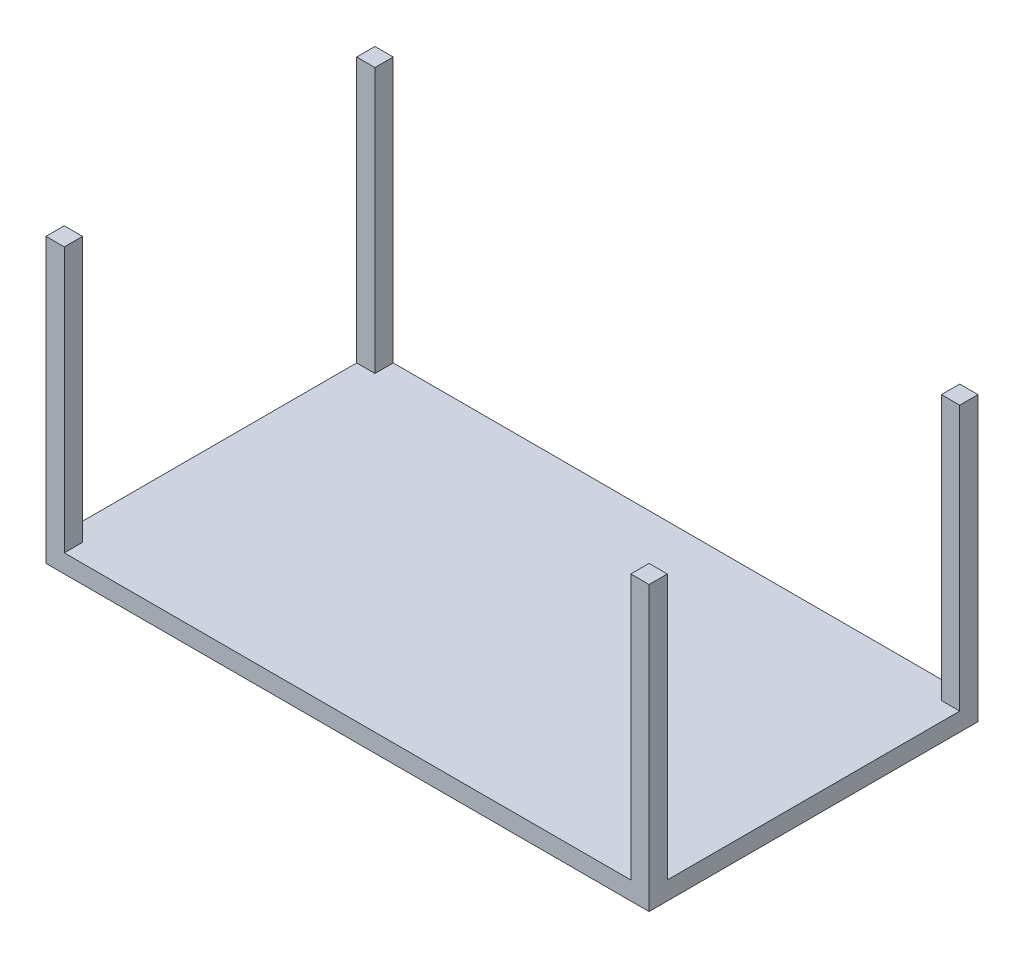
ISO-10303-21;
HEADER;
FILE_DESCRIPTION(('STEP AP214'),'2;1');
FILE_NAME('part.step','',(''),(''),'','','');
FILE_SCHEMA(('AUTOMOTIVE_DESIGN { 1 0 10303 214 1 1 1 1 }'));
ENDSEC;
DATA;
#1=APPLICATION_CONTEXT('core data for automotive mechanical design processes');
#2=APPLICATION_PROTOCOL_DEFINITION('international standard','automotive_design',2000,#1);
#3=PRODUCT_CONTEXT('',#1,'mechanical');
#4=PRODUCT('Part','Part','',(#3));
#5=PRODUCT_RELATED_PRODUCT_CATEGORY('part','',(#4));
#6=PRODUCT_DEFINITION_FORMATION('','',#4);
#7=PRODUCT_DEFINITION_CONTEXT('part definition',#1,'design');
#8=PRODUCT_DEFINITION('design','',#6,#7);
#9=PRODUCT_DEFINITION_SHAPE('','',#8);
#10=(LENGTH_UNIT() NAMED_UNIT(*) SI_UNIT(.MILLI.,.METRE.));
#11=(NAMED_UNIT(*) PLANE_ANGLE_UNIT() SI_UNIT($,.RADIAN.));
#12=(NAMED_UNIT(*) SI_UNIT($,.STERADIAN.) SOLID_ANGLE_UNIT());
#13=UNCERTAINTY_MEASURE_WITH_UNIT(LENGTH_MEASURE(1.E-05),#10,'distance_accuracy_value','');
#14=(GEOMETRIC_REPRESENTATION_CONTEXT(3) GLOBAL_UNCERTAINTY_ASSIGNED_CONTEXT((#13)) GLOBAL_UNIT_ASSIGNED_CONTEXT((#10,
#11,#12)) REPRESENTATION_CONTEXT('',''));
#15=CARTESIAN_POINT('',(0.,0.,0.));
#16=DIRECTION('',(0.,0.,1.));
#17=DIRECTION('',(1.,0.,0.));
#18=AXIS2_PLACEMENT_3D('',#15,#16,#17);
#19=CARTESIAN_POINT('',(0.,50.8,0.));
#20=DIRECTION('',(0.,-1.,0.));
#21=DIRECTION('',(0.,0.,-1.));
#22=AXIS2_PLACEMENT_3D('',#19,#20,#21);
#23=PLANE('',#22);
#24=DIRECTION('',(0.,0.,-1.));
#25=VECTOR('',#24,1.);
#26=CARTESIAN_POINT('',(-787.4,50.8,457.2));
#27=LINE('',#26,#25);
#28=CARTESIAN_POINT('',(-787.4,50.8,457.2));
#29=VERTEX_POINT('',#28);
#30=CARTESIAN_POINT('',(-787.4,50.8,406.4));
#31=VERTEX_POINT('',#30);
#32=EDGE_CURVE('E197',#29,#31,#27,.T.);
#33=ORIENTED_EDGE('',*,*,#32,.F.);
#34=DIRECTION('',(1.,0.,0.));
#35=VECTOR('',#34,1.);
#36=CARTESIAN_POINT('',(-838.2,50.8,457.2));
#37=LINE('',#36,#35);
#38=CARTESIAN_POINT('',(787.4,50.8,457.2));
#39=VERTEX_POINT('',#38);
#40=EDGE_CURVE('E313',#29,#39,#37,.T.);
#41=ORIENTED_EDGE('',*,*,#40,.T.);
#42=DIRECTION('',(0.,0.,1.));
#43=VECTOR('',#42,1.);
#44=CARTESIAN_POINT('',(787.4,50.8,457.2));
#45=LINE('',#44,#43);
#46=CARTESIAN_POINT('',(787.4,50.8,406.4));
#47=VERTEX_POINT('',#46);
#48=EDGE_CURVE('E215',#47,#39,#45,.T.);
#49=ORIENTED_EDGE('',*,*,#48,.F.);
#50=DIRECTION('',(-1.,0.,0.));
#51=VECTOR('',#50,1.);
#52=CARTESIAN_POINT('',(838.2,50.8,406.4));
#53=LINE('',#52,#51);
#54=CARTESIAN_POINT('',(838.2,50.8,406.4));
#55=VERTEX_POINT('',#54);
#56=EDGE_CURVE('E209',#55,#47,#53,.T.);
#57=ORIENTED_EDGE('',*,*,#56,.F.);
#58=DIRECTION('',(0.,0.,-1.));
#59=VECTOR('',#58,1.);
#60=CARTESIAN_POINT('',(838.2,50.8,457.2));
#61=LINE('',#60,#59);
#62=CARTESIAN_POINT('',(838.2,50.8,-406.4));
#63=VERTEX_POINT('',#62);
#64=EDGE_CURVE('E305',#55,#63,#61,.T.);
#65=ORIENTED_EDGE('',*,*,#64,.T.);
#66=DIRECTION('',(1.,0.,0.));
#67=VECTOR('',#66,1.);
#68=CARTESIAN_POINT('',(838.2,50.8,-406.4));
#69=LINE('',#68,#67);
#70=CARTESIAN_POINT('',(787.4,50.8,-406.4));
#71=VERTEX_POINT('',#70);
#72=EDGE_CURVE('E246',#71,#63,#69,.T.);
#73=ORIENTED_EDGE('',*,*,#72,.F.);
#74=DIRECTION('',(0.,0.,1.));
#75=VECTOR('',#74,1.);
#76=CARTESIAN_POINT('',(787.4,50.8,-457.2));
#77=LINE('',#76,#75);
#78=CARTESIAN_POINT('',(787.4,50.8,-457.2));
#79=VERTEX_POINT('',#78);
#80=EDGE_CURVE('E241',#79,#71,#77,.T.);
#81=ORIENTED_EDGE('',*,*,#80,.F.);
#82=DIRECTION('',(-1.,0.,0.));
#83=VECTOR('',#82,1.);
#84=CARTESIAN_POINT('',(-838.2,50.8,-457.2));
#85=LINE('',#84,#83);
#86=CARTESIAN_POINT('',(-787.4,50.8,-457.2));
#87=VERTEX_POINT('',#86);
#88=EDGE_CURVE('E308',#79,#87,#85,.T.);
#89=ORIENTED_EDGE('',*,*,#88,.T.);
#90=DIRECTION('',(0.,0.,-1.));
#91=VECTOR('',#90,1.);
#92=CARTESIAN_POINT('',(-787.4,50.8,-457.2));
#93=LINE('',#92,#91);
#94=CARTESIAN_POINT('',(-787.4,50.8,-406.4));
#95=VERTEX_POINT('',#94);
#96=EDGE_CURVE('E276',#95,#87,#93,.T.);
#97=ORIENTED_EDGE('',*,*,#96,.F.);
#98=DIRECTION('',(1.,0.,0.));
#99=VECTOR('',#98,1.);
#100=CARTESIAN_POINT('',(-838.2,50.8,-406.4));
#101=LINE('',#100,#99);
#102=CARTESIAN_POINT('',(-838.2,50.8,-406.4));
#103=VERTEX_POINT('',#102);
#104=EDGE_CURVE('E270',#103,#95,#101,.T.);
#105=ORIENTED_EDGE('',*,*,#104,.F.);
#106=DIRECTION('',(0.,0.,1.));
#107=VECTOR('',#106,1.);
#108=CARTESIAN_POINT('',(-838.2,50.8,457.2));
#109=LINE('',#108,#107);
#110=CARTESIAN_POINT('',(-838.2,50.8,406.4));
#111=VERTEX_POINT('',#110);
#112=EDGE_CURVE('E63',#103,#111,#109,.T.);
#113=ORIENTED_EDGE('',*,*,#112,.T.);
#114=DIRECTION('',(-1.,0.,0.));
#115=VECTOR('',#114,1.);
#116=CARTESIAN_POINT('',(-838.2,50.8,406.4));
#117=LINE('',#116,#115);
#118=EDGE_CURVE('E58',#31,#111,#117,.T.);
#119=ORIENTED_EDGE('',*,*,#118,.F.);
#120=EDGE_LOOP('',(#33,#41,#49,#57,#65,#73,#81,#89,#97,#105,#113,#119));
#121=FACE_BOUND('',#120,.T.);
#122=ADVANCED_FACE('F42',(#121),#23,.F.);
#123=CARTESIAN_POINT('',(838.2,50.8,457.2));
#124=DIRECTION('',(-1.,0.,0.));
#125=DIRECTION('',(0.,0.,1.));
#126=AXIS2_PLACEMENT_3D('',#123,#124,#125);
#127=PLANE('',#126);
#128=DIRECTION('',(0.,0.,-1.));
#129=VECTOR('',#128,1.);
#130=CARTESIAN_POINT('',(838.2,0.,457.2));
#131=LINE('',#130,#129);
#132=CARTESIAN_POINT('',(838.2,0.,457.2));
#133=VERTEX_POINT('',#132);
#134=CARTESIAN_POINT('',(838.2,0.,-457.2));
#135=VERTEX_POINT('',#134);
#136=EDGE_CURVE('E304',#133,#135,#131,.T.);
#137=ORIENTED_EDGE('',*,*,#136,.T.);
#138=DIRECTION('',(0.,-1.,0.));
#139=VECTOR('',#138,1.);
#140=CARTESIAN_POINT('',(838.2,50.8,-457.2));
#141=LINE('',#140,#139);
#142=CARTESIAN_POINT('',(838.2,787.4,-457.2));
#143=VERTEX_POINT('',#142);
#144=EDGE_CURVE('E11',#143,#135,#141,.T.);
#145=ORIENTED_EDGE('',*,*,#144,.F.);
#146=DIRECTION('',(0.,0.,-1.));
#147=VECTOR('',#146,1.);
#148=CARTESIAN_POINT('',(838.2,787.4,-457.2));
#149=LINE('',#148,#147);
#150=CARTESIAN_POINT('',(838.2,787.4,-406.4));
#151=VERTEX_POINT('',#150);
#152=EDGE_CURVE('E242',#151,#143,#149,.T.);
#153=ORIENTED_EDGE('',*,*,#152,.F.);
#154=DIRECTION('',(0.,-1.,0.));
#155=VECTOR('',#154,1.);
#156=CARTESIAN_POINT('',(838.2,787.4,-406.4));
#157=LINE('',#156,#155);
#158=EDGE_CURVE('E252',#151,#63,#157,.T.);
#159=ORIENTED_EDGE('',*,*,#158,.T.);
#160=ORIENTED_EDGE('',*,*,#64,.F.);
#161=DIRECTION('',(0.,-1.,0.));
#162=VECTOR('',#161,1.);
#163=CARTESIAN_POINT('',(838.2,787.4,406.4));
#164=LINE('',#163,#162);
#165=CARTESIAN_POINT('',(838.2,787.4,406.4));
#166=VERTEX_POINT('',#165);
#167=EDGE_CURVE('E237',#166,#55,#164,.T.);
#168=ORIENTED_EDGE('',*,*,#167,.F.);
#169=DIRECTION('',(0.,0.,-1.));
#170=VECTOR('',#169,1.);
#171=CARTESIAN_POINT('',(838.2,787.4,457.2));
#172=LINE('',#171,#170);
#173=CARTESIAN_POINT('',(838.2,787.4,457.2));
#174=VERTEX_POINT('',#173);
#175=EDGE_CURVE('E210',#174,#166,#172,.T.);
#176=ORIENTED_EDGE('',*,*,#175,.F.);
#177=DIRECTION('',(0.,-1.,0.));
#178=VECTOR('',#177,1.);
#179=CARTESIAN_POINT('',(838.2,50.8,457.2));
#180=LINE('',#179,#178);
#181=EDGE_CURVE('E181',#174,#133,#180,.T.);
#182=ORIENTED_EDGE('',*,*,#181,.T.);
#183=EDGE_LOOP('',(#137,#145,#153,#159,#160,#168,#176,#182));
#184=FACE_BOUND('',#183,.T.);
#185=ADVANCED_FACE('F44',(#184),#127,.F.);
#186=CARTESIAN_POINT('',(-838.2,50.8,-457.2));
#187=DIRECTION('',(0.,0.,1.));
#188=DIRECTION('',(1.,0.,0.));
#189=AXIS2_PLACEMENT_3D('',#186,#187,#188);
#190=PLANE('',#189);
#191=DIRECTION('',(-1.,0.,0.));
#192=VECTOR('',#191,1.);
#193=CARTESIAN_POINT('',(-838.2,0.,-457.2));
#194=LINE('',#193,#192);
#195=CARTESIAN_POINT('',(-838.2,0.,-457.2));
#196=VERTEX_POINT('',#195);
#197=EDGE_CURVE('E319',#135,#196,#194,.T.);
#198=ORIENTED_EDGE('',*,*,#197,.T.);
#199=DIRECTION('',(0.,-1.,0.));
#200=VECTOR('',#199,1.);
#201=CARTESIAN_POINT('',(-838.2,50.8,-457.2));
#202=LINE('',#201,#200);
#203=CARTESIAN_POINT('',(-838.2,787.4,-457.2));
#204=VERTEX_POINT('',#203);
#205=EDGE_CURVE('E51',#204,#196,#202,.T.);
#206=ORIENTED_EDGE('',*,*,#205,.F.);
#207=DIRECTION('',(-1.,0.,0.));
#208=VECTOR('',#207,1.);
#209=CARTESIAN_POINT('',(-838.2,787.4,-457.2));
#210=LINE('',#209,#208);
#211=CARTESIAN_POINT('',(-787.4,787.4,-457.2));
#212=VERTEX_POINT('',#211);
#213=EDGE_CURVE('E282',#212,#204,#210,.T.);
#214=ORIENTED_EDGE('',*,*,#213,.F.);
#215=DIRECTION('',(0.,-1.,0.));
#216=VECTOR('',#215,1.);
#217=CARTESIAN_POINT('',(-787.4,787.4,-457.2));
#218=LINE('',#217,#216);
#219=EDGE_CURVE('E286',#212,#87,#218,.T.);
#220=ORIENTED_EDGE('',*,*,#219,.T.);
#221=ORIENTED_EDGE('',*,*,#88,.F.);
#222=DIRECTION('',(0.,-1.,0.));
#223=VECTOR('',#222,1.);
#224=CARTESIAN_POINT('',(787.4,787.4,-457.2));
#225=LINE('',#224,#223);
#226=CARTESIAN_POINT('',(787.4,787.4,-457.2));
#227=VERTEX_POINT('',#226);
#228=EDGE_CURVE('E266',#227,#79,#225,.T.);
#229=ORIENTED_EDGE('',*,*,#228,.F.);
#230=DIRECTION('',(-1.,0.,0.));
#231=VECTOR('',#230,1.);
#232=CARTESIAN_POINT('',(838.2,787.4,-457.2));
#233=LINE('',#232,#231);
#234=EDGE_CURVE('E245',#143,#227,#233,.T.);
#235=ORIENTED_EDGE('',*,*,#234,.F.);
#236=ORIENTED_EDGE('',*,*,#144,.T.);
#237=EDGE_LOOP('',(#198,#206,#214,#220,#221,#229,#235,#236));
#238=FACE_BOUND('',#237,.T.);
#239=ADVANCED_FACE('F365',(#238),#190,.F.);
#240=CARTESIAN_POINT('',(-838.2,50.8,457.2));
#241=DIRECTION('',(1.,0.,0.));
#242=DIRECTION('',(0.,0.,-1.));
#243=AXIS2_PLACEMENT_3D('',#240,#241,#242);
#244=PLANE('',#243);
#245=DIRECTION('',(0.,0.,1.));
#246=VECTOR('',#245,1.);
#247=CARTESIAN_POINT('',(-838.2,0.,457.2));
#248=LINE('',#247,#246);
#249=CARTESIAN_POINT('',(-838.2,0.,457.2));
#250=VERTEX_POINT('',#249);
#251=EDGE_CURVE('E178',#196,#250,#248,.T.);
#252=ORIENTED_EDGE('',*,*,#251,.T.);
#253=DIRECTION('',(0.,-1.,0.));
#254=VECTOR('',#253,1.);
#255=CARTESIAN_POINT('',(-838.2,50.8,457.2));
#256=LINE('',#255,#254);
#257=CARTESIAN_POINT('',(-838.2,787.4,457.2));
#258=VERTEX_POINT('',#257);
#259=EDGE_CURVE('E170',#258,#250,#256,.T.);
#260=ORIENTED_EDGE('',*,*,#259,.F.);
#261=DIRECTION('',(0.,0.,1.));
#262=VECTOR('',#261,1.);
#263=CARTESIAN_POINT('',(-838.2,787.4,457.2));
#264=LINE('',#263,#262);
#265=CARTESIAN_POINT('',(-838.2,787.4,406.4));
#266=VERTEX_POINT('',#265);
#267=EDGE_CURVE('E175',#266,#258,#264,.T.);
#268=ORIENTED_EDGE('',*,*,#267,.F.);
#269=DIRECTION('',(0.,-1.,0.));
#270=VECTOR('',#269,1.);
#271=CARTESIAN_POINT('',(-838.2,787.4,406.4));
#272=LINE('',#271,#270);
#273=EDGE_CURVE('E202',#266,#111,#272,.T.);
#274=ORIENTED_EDGE('',*,*,#273,.T.);
#275=ORIENTED_EDGE('',*,*,#112,.F.);
#276=DIRECTION('',(0.,-1.,0.));
#277=VECTOR('',#276,1.);
#278=CARTESIAN_POINT('',(-838.2,787.4,-406.4));
#279=LINE('',#278,#277);
#280=CARTESIAN_POINT('',(-838.2,787.4,-406.4));
#281=VERTEX_POINT('',#280);
#282=EDGE_CURVE('E300',#281,#103,#279,.T.);
#283=ORIENTED_EDGE('',*,*,#282,.F.);
#284=DIRECTION('',(0.,0.,1.));
#285=VECTOR('',#284,1.);
#286=CARTESIAN_POINT('',(-838.2,787.4,-457.2));
#287=LINE('',#286,#285);
#288=EDGE_CURVE('E271',#204,#281,#287,.T.);
#289=ORIENTED_EDGE('',*,*,#288,.F.);
#290=ORIENTED_EDGE('',*,*,#205,.T.);
#291=EDGE_LOOP('',(#252,#260,#268,#274,#275,#283,#289,#290));
#292=FACE_BOUND('',#291,.T.);
#293=ADVANCED_FACE('F172',(#292),#244,.F.);
#294=CARTESIAN_POINT('',(-838.2,50.8,457.2));
#295=DIRECTION('',(0.,0.,-1.));
#296=DIRECTION('',(-1.,0.,0.));
#297=AXIS2_PLACEMENT_3D('',#294,#295,#296);
#298=PLANE('',#297);
#299=DIRECTION('',(1.,0.,0.));
#300=VECTOR('',#299,1.);
#301=CARTESIAN_POINT('',(-838.2,0.,457.2));
#302=LINE('',#301,#300);
#303=EDGE_CURVE('E309',#250,#133,#302,.T.);
#304=ORIENTED_EDGE('',*,*,#303,.T.);
#305=ORIENTED_EDGE('',*,*,#181,.F.);
#306=DIRECTION('',(1.,0.,0.));
#307=VECTOR('',#306,1.);
#308=CARTESIAN_POINT('',(838.2,787.4,457.2));
#309=LINE('',#308,#307);
#310=CARTESIAN_POINT('',(787.4,787.4,457.2));
#311=VERTEX_POINT('',#310);
#312=EDGE_CURVE('E221',#311,#174,#309,.T.);
#313=ORIENTED_EDGE('',*,*,#312,.F.);
#314=DIRECTION('',(0.,-1.,0.));
#315=VECTOR('',#314,1.);
#316=CARTESIAN_POINT('',(787.4,787.4,457.2));
#317=LINE('',#316,#315);
#318=EDGE_CURVE('E225',#311,#39,#317,.T.);
#319=ORIENTED_EDGE('',*,*,#318,.T.);
#320=ORIENTED_EDGE('',*,*,#40,.F.);
#321=DIRECTION('',(0.,-1.,0.));
#322=VECTOR('',#321,1.);
#323=CARTESIAN_POINT('',(-787.4,787.4,457.2));
#324=LINE('',#323,#322);
#325=CARTESIAN_POINT('',(-787.4,787.4,457.2));
#326=VERTEX_POINT('',#325);
#327=EDGE_CURVE('E187',#326,#29,#324,.T.);
#328=ORIENTED_EDGE('',*,*,#327,.F.);
#329=DIRECTION('',(1.,0.,0.));
#330=VECTOR('',#329,1.);
#331=CARTESIAN_POINT('',(-838.2,787.4,457.2));
#332=LINE('',#331,#330);
#333=EDGE_CURVE('E184',#258,#326,#332,.T.);
#334=ORIENTED_EDGE('',*,*,#333,.F.);
#335=ORIENTED_EDGE('',*,*,#259,.T.);
#336=EDGE_LOOP('',(#304,#305,#313,#319,#320,#328,#334,#335));
#337=FACE_BOUND('',#336,.T.);
#338=ADVANCED_FACE('F185',(#337),#298,.F.);
#339=CARTESIAN_POINT('',(0.,0.,0.));
#340=DIRECTION('',(0.,-1.,0.));
#341=DIRECTION('',(0.,0.,-1.));
#342=AXIS2_PLACEMENT_3D('',#339,#340,#341);
#343=PLANE('',#342);
#344=ORIENTED_EDGE('',*,*,#136,.F.);
#345=ORIENTED_EDGE('',*,*,#303,.F.);
#346=ORIENTED_EDGE('',*,*,#251,.F.);
#347=ORIENTED_EDGE('',*,*,#197,.F.);
#348=EDGE_LOOP('',(#344,#345,#346,#347));
#349=FACE_BOUND('',#348,.T.);
#350=ADVANCED_FACE('F334',(#349),#343,.T.);
#351=CARTESIAN_POINT('',(-838.2,787.4,-406.4));
#352=DIRECTION('',(0.,0.,-1.));
#353=DIRECTION('',(-1.,0.,0.));
#354=AXIS2_PLACEMENT_3D('',#351,#352,#353);
#355=PLANE('',#354);
#356=ORIENTED_EDGE('',*,*,#104,.T.);
#357=DIRECTION('',(0.,-1.,0.));
#358=VECTOR('',#357,1.);
#359=CARTESIAN_POINT('',(-787.4,787.4,-406.4));
#360=LINE('',#359,#358);
#361=CARTESIAN_POINT('',(-787.4,787.4,-406.4));
#362=VERTEX_POINT('',#361);
#363=EDGE_CURVE('E296',#362,#95,#360,.T.);
#364=ORIENTED_EDGE('',*,*,#363,.F.);
#365=DIRECTION('',(1.,0.,0.));
#366=VECTOR('',#365,1.);
#367=CARTESIAN_POINT('',(-838.2,787.4,-406.4));
#368=LINE('',#367,#366);
#369=EDGE_CURVE('E275',#281,#362,#368,.T.);
#370=ORIENTED_EDGE('',*,*,#369,.F.);
#371=ORIENTED_EDGE('',*,*,#282,.T.);
#372=EDGE_LOOP('',(#356,#364,#370,#371));
#373=FACE_BOUND('',#372,.T.);
#374=ADVANCED_FACE('F368',(#373),#355,.F.);
#375=CARTESIAN_POINT('',(-787.4,787.4,-457.2));
#376=DIRECTION('',(-1.,0.,0.));
#377=DIRECTION('',(0.,0.,1.));
#378=AXIS2_PLACEMENT_3D('',#375,#376,#377);
#379=PLANE('',#378);
#380=ORIENTED_EDGE('',*,*,#96,.T.);
#381=ORIENTED_EDGE('',*,*,#219,.F.);
#382=DIRECTION('',(0.,0.,-1.));
#383=VECTOR('',#382,1.);
#384=CARTESIAN_POINT('',(-787.4,787.4,-457.2));
#385=LINE('',#384,#383);
#386=EDGE_CURVE('E279',#362,#212,#385,.T.);
#387=ORIENTED_EDGE('',*,*,#386,.F.);
#388=ORIENTED_EDGE('',*,*,#363,.T.);
#389=EDGE_LOOP('',(#380,#381,#387,#388));
#390=FACE_BOUND('',#389,.T.);
#391=ADVANCED_FACE('F391',(#390),#379,.F.);
#392=CARTESIAN_POINT('',(0.,787.4,0.));
#393=DIRECTION('',(0.,1.,0.));
#394=DIRECTION('',(0.,0.,1.));
#395=AXIS2_PLACEMENT_3D('',#392,#393,#394);
#396=PLANE('',#395);
#397=ORIENTED_EDGE('',*,*,#288,.T.);
#398=ORIENTED_EDGE('',*,*,#369,.T.);
#399=ORIENTED_EDGE('',*,*,#386,.T.);
#400=ORIENTED_EDGE('',*,*,#213,.T.);
#401=EDGE_LOOP('',(#397,#398,#399,#400));
#402=FACE_BOUND('',#401,.T.);
#403=ADVANCED_FACE('F462',(#402),#396,.T.);
#404=CARTESIAN_POINT('',(787.4,787.4,-457.2));
#405=DIRECTION('',(1.,0.,0.));
#406=DIRECTION('',(0.,0.,-1.));
#407=AXIS2_PLACEMENT_3D('',#404,#405,#406);
#408=PLANE('',#407);
#409=ORIENTED_EDGE('',*,*,#80,.T.);
#410=DIRECTION('',(0.,-1.,0.));
#411=VECTOR('',#410,1.);
#412=CARTESIAN_POINT('',(787.4,787.4,-406.4));
#413=LINE('',#412,#411);
#414=CARTESIAN_POINT('',(787.4,787.4,-406.4));
#415=VERTEX_POINT('',#414);
#416=EDGE_CURVE('E262',#415,#71,#413,.T.);
#417=ORIENTED_EDGE('',*,*,#416,.F.);
#418=DIRECTION('',(0.,0.,1.));
#419=VECTOR('',#418,1.);
#420=CARTESIAN_POINT('',(787.4,787.4,-457.2));
#421=LINE('',#420,#419);
#422=EDGE_CURVE('E248',#227,#415,#421,.T.);
#423=ORIENTED_EDGE('',*,*,#422,.F.);
#424=ORIENTED_EDGE('',*,*,#228,.T.);
#425=EDGE_LOOP('',(#409,#417,#423,#424));
#426=FACE_BOUND('',#425,.T.);
#427=ADVANCED_FACE('F388',(#426),#408,.F.);
#428=CARTESIAN_POINT('',(838.2,787.4,-406.4));
#429=DIRECTION('',(0.,0.,-1.));
#430=DIRECTION('',(-1.,0.,0.));
#431=AXIS2_PLACEMENT_3D('',#428,#429,#430);
#432=PLANE('',#431);
#433=ORIENTED_EDGE('',*,*,#72,.T.);
#434=ORIENTED_EDGE('',*,*,#158,.F.);
#435=DIRECTION('',(1.,0.,0.));
#436=VECTOR('',#435,1.);
#437=CARTESIAN_POINT('',(838.2,787.4,-406.4));
#438=LINE('',#437,#436);
#439=EDGE_CURVE('E250',#415,#151,#438,.T.);
#440=ORIENTED_EDGE('',*,*,#439,.F.);
#441=ORIENTED_EDGE('',*,*,#416,.T.);
#442=EDGE_LOOP('',(#433,#434,#440,#441));
#443=FACE_BOUND('',#442,.T.);
#444=ADVANCED_FACE('F357',(#443),#432,.F.);
#445=CARTESIAN_POINT('',(0.,787.4,0.));
#446=DIRECTION('',(0.,-1.,0.));
#447=DIRECTION('',(0.,0.,-1.));
#448=AXIS2_PLACEMENT_3D('',#445,#446,#447);
#449=PLANE('',#448);
#450=ORIENTED_EDGE('',*,*,#152,.T.);
#451=ORIENTED_EDGE('',*,*,#234,.T.);
#452=ORIENTED_EDGE('',*,*,#422,.T.);
#453=ORIENTED_EDGE('',*,*,#439,.T.);
#454=EDGE_LOOP('',(#450,#451,#452,#453));
#455=FACE_BOUND('',#454,.T.);
#456=ADVANCED_FACE('F350',(#455),#449,.F.);
#457=CARTESIAN_POINT('',(838.2,787.4,406.4));
#458=DIRECTION('',(0.,0.,1.));
#459=DIRECTION('',(1.,0.,0.));
#460=AXIS2_PLACEMENT_3D('',#457,#458,#459);
#461=PLANE('',#460);
#462=ORIENTED_EDGE('',*,*,#56,.T.);
#463=DIRECTION('',(0.,-1.,0.));
#464=VECTOR('',#463,1.);
#465=CARTESIAN_POINT('',(787.4,787.4,406.4));
#466=LINE('',#465,#464);
#467=CARTESIAN_POINT('',(787.4,787.4,406.4));
#468=VERTEX_POINT('',#467);
#469=EDGE_CURVE('E233',#468,#47,#466,.T.);
#470=ORIENTED_EDGE('',*,*,#469,.F.);
#471=DIRECTION('',(-1.,0.,0.));
#472=VECTOR('',#471,1.);
#473=CARTESIAN_POINT('',(838.2,787.4,406.4));
#474=LINE('',#473,#472);
#475=EDGE_CURVE('E214',#166,#468,#474,.T.);
#476=ORIENTED_EDGE('',*,*,#475,.F.);
#477=ORIENTED_EDGE('',*,*,#167,.T.);
#478=EDGE_LOOP('',(#462,#470,#476,#477));
#479=FACE_BOUND('',#478,.T.);
#480=ADVANCED_FACE('F348',(#479),#461,.F.);
#481=CARTESIAN_POINT('',(787.4,787.4,457.2));
#482=DIRECTION('',(1.,0.,0.));
#483=DIRECTION('',(0.,0.,-1.));
#484=AXIS2_PLACEMENT_3D('',#481,#482,#483);
#485=PLANE('',#484);
#486=ORIENTED_EDGE('',*,*,#48,.T.);
#487=ORIENTED_EDGE('',*,*,#318,.F.);
#488=DIRECTION('',(0.,0.,1.));
#489=VECTOR('',#488,1.);
#490=CARTESIAN_POINT('',(787.4,787.4,457.2));
#491=LINE('',#490,#489);
#492=EDGE_CURVE('E218',#468,#311,#491,.T.);
#493=ORIENTED_EDGE('',*,*,#492,.F.);
#494=ORIENTED_EDGE('',*,*,#469,.T.);
#495=EDGE_LOOP('',(#486,#487,#493,#494));
#496=FACE_BOUND('',#495,.T.);
#497=ADVANCED_FACE('F346',(#496),#485,.F.);
#498=CARTESIAN_POINT('',(0.,787.4,0.));
#499=DIRECTION('',(0.,1.,0.));
#500=DIRECTION('',(0.,0.,1.));
#501=AXIS2_PLACEMENT_3D('',#498,#499,#500);
#502=PLANE('',#501);
#503=ORIENTED_EDGE('',*,*,#175,.T.);
#504=ORIENTED_EDGE('',*,*,#475,.T.);
#505=ORIENTED_EDGE('',*,*,#492,.T.);
#506=ORIENTED_EDGE('',*,*,#312,.T.);
#507=EDGE_LOOP('',(#503,#504,#505,#506));
#508=FACE_BOUND('',#507,.T.);
#509=ADVANCED_FACE('F341',(#508),#502,.T.);
#510=CARTESIAN_POINT('',(-787.4,787.4,457.2));
#511=DIRECTION('',(-1.,0.,0.));
#512=DIRECTION('',(0.,0.,1.));
#513=AXIS2_PLACEMENT_3D('',#510,#511,#512);
#514=PLANE('',#513);
#515=ORIENTED_EDGE('',*,*,#32,.T.);
#516=DIRECTION('',(0.,-1.,0.));
#517=VECTOR('',#516,1.);
#518=CARTESIAN_POINT('',(-787.4,787.4,406.4));
#519=LINE('',#518,#517);
#520=CARTESIAN_POINT('',(-787.4,787.4,406.4));
#521=VERTEX_POINT('',#520);
#522=EDGE_CURVE('E205',#521,#31,#519,.T.);
#523=ORIENTED_EDGE('',*,*,#522,.F.);
#524=DIRECTION('',(0.,0.,-1.));
#525=VECTOR('',#524,1.);
#526=CARTESIAN_POINT('',(-787.4,787.4,457.2));
#527=LINE('',#526,#525);
#528=EDGE_CURVE('E190',#326,#521,#527,.T.);
#529=ORIENTED_EDGE('',*,*,#528,.F.);
#530=ORIENTED_EDGE('',*,*,#327,.T.);
#531=EDGE_LOOP('',(#515,#523,#529,#530));
#532=FACE_BOUND('',#531,.T.);
#533=ADVANCED_FACE('F399',(#532),#514,.F.);
#534=CARTESIAN_POINT('',(-838.2,787.4,406.4));
#535=DIRECTION('',(0.,0.,1.));
#536=DIRECTION('',(1.,0.,0.));
#537=AXIS2_PLACEMENT_3D('',#534,#535,#536);
#538=PLANE('',#537);
#539=ORIENTED_EDGE('',*,*,#118,.T.);
#540=ORIENTED_EDGE('',*,*,#273,.F.);
#541=DIRECTION('',(-1.,0.,0.));
#542=VECTOR('',#541,1.);
#543=CARTESIAN_POINT('',(-838.2,787.4,406.4));
#544=LINE('',#543,#542);
#545=EDGE_CURVE('E194',#521,#266,#544,.T.);
#546=ORIENTED_EDGE('',*,*,#545,.F.);
#547=ORIENTED_EDGE('',*,*,#522,.T.);
#548=EDGE_LOOP('',(#539,#540,#546,#547));
#549=FACE_BOUND('',#548,.T.);
#550=ADVANCED_FACE('F396',(#549),#538,.F.);
#551=CARTESIAN_POINT('',(0.,787.4,0.));
#552=DIRECTION('',(0.,-1.,0.));
#553=DIRECTION('',(0.,0.,-1.));
#554=AXIS2_PLACEMENT_3D('',#551,#552,#553);
#555=PLANE('',#554);
#556=ORIENTED_EDGE('',*,*,#267,.T.);
#557=ORIENTED_EDGE('',*,*,#333,.T.);
#558=ORIENTED_EDGE('',*,*,#528,.T.);
#559=ORIENTED_EDGE('',*,*,#545,.T.);
#560=EDGE_LOOP('',(#556,#557,#558,#559));
#561=FACE_BOUND('',#560,.T.);
#562=ADVANCED_FACE('F192',(#561),#555,.F.);
#563=CLOSED_SHELL('',(#122,#185,#239,#293,#338,#350,#374,#391,#403,#427,#444,#456,#480,#497,
#509,#533,#550,#562));
#564=MANIFOLD_SOLID_BREP('B2',#563);
#565=ADVANCED_BREP_SHAPE_REPRESENTATION('',(#18,#564),#14);
#566=SHAPE_DEFINITION_REPRESENTATION(#9,#565);
ENDSEC;
END-ISO-10303-21;
